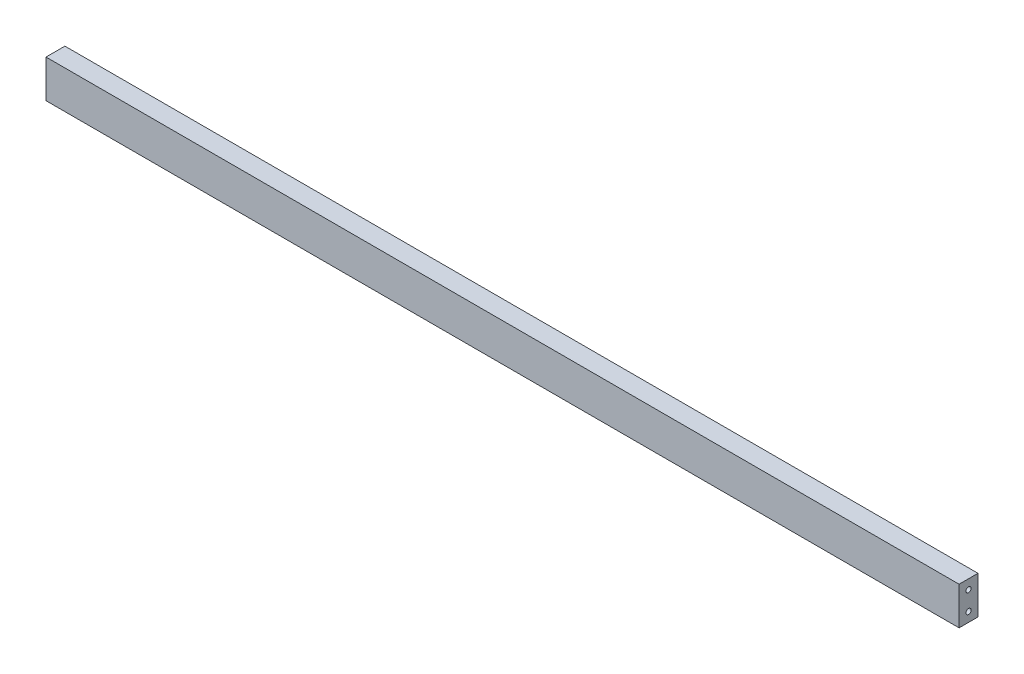
ISO-10303-21;
HEADER;
FILE_DESCRIPTION(('STEP AP214'),'2;1');
FILE_NAME('part.step','',(''),(''),'','','');
FILE_SCHEMA(('AUTOMOTIVE_DESIGN { 1 0 10303 214 1 1 1 1 }'));
ENDSEC;
DATA;
#1=APPLICATION_CONTEXT('core data for automotive mechanical design processes');
#2=APPLICATION_PROTOCOL_DEFINITION('international standard','automotive_design',2000,#1);
#3=PRODUCT_CONTEXT('',#1,'mechanical');
#4=PRODUCT('Part','Part','',(#3));
#5=PRODUCT_RELATED_PRODUCT_CATEGORY('part','',(#4));
#6=PRODUCT_DEFINITION_FORMATION('','',#4);
#7=PRODUCT_DEFINITION_CONTEXT('part definition',#1,'design');
#8=PRODUCT_DEFINITION('design','',#6,#7);
#9=PRODUCT_DEFINITION_SHAPE('','',#8);
#10=(LENGTH_UNIT() NAMED_UNIT(*) SI_UNIT(.MILLI.,.METRE.));
#11=(NAMED_UNIT(*) PLANE_ANGLE_UNIT() SI_UNIT($,.RADIAN.));
#12=(NAMED_UNIT(*) SI_UNIT($,.STERADIAN.) SOLID_ANGLE_UNIT());
#13=UNCERTAINTY_MEASURE_WITH_UNIT(LENGTH_MEASURE(1.E-05),#10,'distance_accuracy_value','');
#14=(GEOMETRIC_REPRESENTATION_CONTEXT(3) GLOBAL_UNCERTAINTY_ASSIGNED_CONTEXT((#13)) GLOBAL_UNIT_ASSIGNED_CONTEXT((#10,
#11,#12)) REPRESENTATION_CONTEXT('',''));
#15=CARTESIAN_POINT('',(0.,0.,0.));
#16=DIRECTION('',(0.,0.,1.));
#17=DIRECTION('',(1.,0.,0.));
#18=AXIS2_PLACEMENT_3D('',#15,#16,#17);
#19=CARTESIAN_POINT('',(521.515,9.99999999999997,0.));
#20=DIRECTION('',(1.,0.,0.));
#21=DIRECTION('',(0.,0.,-1.));
#22=AXIS2_PLACEMENT_3D('',#19,#20,#21);
#23=CYLINDRICAL_SURFACE('',#22,2.75);
#24=CARTESIAN_POINT('',(965.6,9.99999999999994,0.));
#25=DIRECTION('',(-1.,0.,0.));
#26=DIRECTION('',(0.,0.,1.));
#27=AXIS2_PLACEMENT_3D('',#24,#25,#26);
#28=CIRCLE('',#27,2.75);
#29=CARTESIAN_POINT('',(965.6,9.99999999999994,2.75000000000006));
#30=VERTEX_POINT('',#29);
#31=EDGE_CURVE('E109',#30,#30,#28,.F.);
#32=ORIENTED_EDGE('',*,*,#31,.T.);
#33=EDGE_LOOP('',(#32));
#34=FACE_BOUND('',#33,.T.);
#35=CARTESIAN_POINT('',(0.,10.,0.));
#36=DIRECTION('',(1.,0.,0.));
#37=DIRECTION('',(0.,0.,-1.));
#38=AXIS2_PLACEMENT_3D('',#35,#36,#37);
#39=CIRCLE('',#38,2.75);
#40=CARTESIAN_POINT('',(0.,10.,-2.75));
#41=VERTEX_POINT('',#40);
#42=EDGE_CURVE('E38',#41,#41,#39,.F.);
#43=ORIENTED_EDGE('',*,*,#42,.T.);
#44=EDGE_LOOP('',(#43));
#45=FACE_BOUND('',#44,.T.);
#46=ADVANCED_FACE('F35',(#34,#45),#23,.F.);
#47=CARTESIAN_POINT('',(521.515,-10.,0.));
#48=DIRECTION('',(1.,0.,0.));
#49=DIRECTION('',(0.,0.,-1.));
#50=AXIS2_PLACEMENT_3D('',#47,#48,#49);
#51=CYLINDRICAL_SURFACE('',#50,2.75);
#52=CARTESIAN_POINT('',(965.6,-10.0000000000001,0.));
#53=DIRECTION('',(-1.,0.,0.));
#54=DIRECTION('',(0.,0.,1.));
#55=AXIS2_PLACEMENT_3D('',#52,#53,#54);
#56=CIRCLE('',#55,2.75);
#57=CARTESIAN_POINT('',(965.6,-10.0000000000001,2.75000000000006));
#58=VERTEX_POINT('',#57);
#59=EDGE_CURVE('E145',#58,#58,#56,.F.);
#60=ORIENTED_EDGE('',*,*,#59,.T.);
#61=EDGE_LOOP('',(#60));
#62=FACE_BOUND('',#61,.T.);
#63=CARTESIAN_POINT('',(0.,-10.,0.));
#64=DIRECTION('',(1.,0.,0.));
#65=DIRECTION('',(0.,0.,-1.));
#66=AXIS2_PLACEMENT_3D('',#63,#64,#65);
#67=CIRCLE('',#66,2.75);
#68=CARTESIAN_POINT('',(0.,-10.,-2.75));
#69=VERTEX_POINT('',#68);
#70=EDGE_CURVE('E107',#69,#69,#67,.F.);
#71=ORIENTED_EDGE('',*,*,#70,.T.);
#72=EDGE_LOOP('',(#71));
#73=FACE_BOUND('',#72,.T.);
#74=ADVANCED_FACE('F135',(#62,#73),#51,.F.);
#75=CARTESIAN_POINT('',(521.515,0.,10.));
#76=DIRECTION('',(0.,0.,-1.));
#77=DIRECTION('',(-1.,0.,0.));
#78=AXIS2_PLACEMENT_3D('',#75,#76,#77);
#79=PLANE('',#78);
#80=DIRECTION('',(1.,0.,0.));
#81=VECTOR('',#80,1.);
#82=CARTESIAN_POINT('',(521.515,-20.,10.0000000000001));
#83=LINE('',#82,#81);
#84=CARTESIAN_POINT('',(965.6,-19.9999999999999,10.0000000000001));
#85=VERTEX_POINT('',#84);
#86=CARTESIAN_POINT('',(0.,-20.,10.));
#87=VERTEX_POINT('',#86);
#88=EDGE_CURVE('E74',#85,#87,#83,.F.);
#89=ORIENTED_EDGE('',*,*,#88,.F.);
#90=DIRECTION('',(0.,-1.,0.));
#91=VECTOR('',#90,1.);
#92=CARTESIAN_POINT('',(965.6,20.0000000000001,10.0000000000001));
#93=LINE('',#92,#91);
#94=CARTESIAN_POINT('',(965.6,20.0000000000001,10.0000000000001));
#95=VERTEX_POINT('',#94);
#96=EDGE_CURVE('E79',#95,#85,#93,.T.);
#97=ORIENTED_EDGE('',*,*,#96,.F.);
#98=DIRECTION('',(1.,0.,0.));
#99=VECTOR('',#98,1.);
#100=CARTESIAN_POINT('',(521.515,20.,10.0000000000001));
#101=LINE('',#100,#99);
#102=CARTESIAN_POINT('',(0.,20.,10.));
#103=VERTEX_POINT('',#102);
#104=EDGE_CURVE('E91',#95,#103,#101,.F.);
#105=ORIENTED_EDGE('',*,*,#104,.T.);
#106=DIRECTION('',(0.,1.,0.));
#107=VECTOR('',#106,1.);
#108=CARTESIAN_POINT('',(0.,0.,10.));
#109=LINE('',#108,#107);
#110=EDGE_CURVE('E97',#103,#87,#109,.F.);
#111=ORIENTED_EDGE('',*,*,#110,.T.);
#112=EDGE_LOOP('',(#89,#97,#105,#111));
#113=FACE_BOUND('',#112,.T.);
#114=ADVANCED_FACE('F133',(#113),#79,.F.);
#115=CARTESIAN_POINT('',(521.515,-20.,0.));
#116=DIRECTION('',(0.,-1.,0.));
#117=DIRECTION('',(1.,0.,0.));
#118=AXIS2_PLACEMENT_3D('',#115,#116,#117);
#119=PLANE('',#118);
#120=DIRECTION('',(0.,0.,-1.));
#121=VECTOR('',#120,1.);
#122=CARTESIAN_POINT('',(965.6,-19.9999999999999,-9.99999999999996));
#123=LINE('',#122,#121);
#124=CARTESIAN_POINT('',(965.6,-20.,-9.99999999999997));
#125=VERTEX_POINT('',#124);
#126=EDGE_CURVE('E51',#85,#125,#123,.T.);
#127=ORIENTED_EDGE('',*,*,#126,.F.);
#128=ORIENTED_EDGE('',*,*,#88,.T.);
#129=DIRECTION('',(0.,0.,-1.));
#130=VECTOR('',#129,1.);
#131=CARTESIAN_POINT('',(0.,-20.,0.));
#132=LINE('',#131,#130);
#133=CARTESIAN_POINT('',(0.,-20.,-9.99999999999999));
#134=VERTEX_POINT('',#133);
#135=EDGE_CURVE('E105',#87,#134,#132,.T.);
#136=ORIENTED_EDGE('',*,*,#135,.T.);
#137=DIRECTION('',(1.,0.,0.));
#138=VECTOR('',#137,1.);
#139=CARTESIAN_POINT('',(521.515,-20.,-9.99999999999997));
#140=LINE('',#139,#138);
#141=EDGE_CURVE('E95',#134,#125,#140,.T.);
#142=ORIENTED_EDGE('',*,*,#141,.T.);
#143=EDGE_LOOP('',(#127,#128,#136,#142));
#144=FACE_BOUND('',#143,.T.);
#145=ADVANCED_FACE('F126',(#144),#119,.T.);
#146=CARTESIAN_POINT('',(521.515,20.,0.));
#147=DIRECTION('',(0.,-1.,0.));
#148=DIRECTION('',(1.,0.,0.));
#149=AXIS2_PLACEMENT_3D('',#146,#147,#148);
#150=PLANE('',#149);
#151=ORIENTED_EDGE('',*,*,#104,.F.);
#152=DIRECTION('',(0.,0.,1.));
#153=VECTOR('',#152,1.);
#154=CARTESIAN_POINT('',(965.6,20.0000000000001,-9.99999999999996));
#155=LINE('',#154,#153);
#156=CARTESIAN_POINT('',(965.6,20.0000000000001,-9.99999999999996));
#157=VERTEX_POINT('',#156);
#158=EDGE_CURVE('E81',#157,#95,#155,.T.);
#159=ORIENTED_EDGE('',*,*,#158,.F.);
#160=DIRECTION('',(1.,0.,0.));
#161=VECTOR('',#160,1.);
#162=CARTESIAN_POINT('',(521.515,20.0000000000001,-9.99999999999997));
#163=LINE('',#162,#161);
#164=CARTESIAN_POINT('',(0.,20.,-9.99999999999999));
#165=VERTEX_POINT('',#164);
#166=EDGE_CURVE('E43',#157,#165,#163,.F.);
#167=ORIENTED_EDGE('',*,*,#166,.T.);
#168=DIRECTION('',(0.,0.,-1.));
#169=VECTOR('',#168,1.);
#170=CARTESIAN_POINT('',(0.,20.,0.));
#171=LINE('',#170,#169);
#172=EDGE_CURVE('E103',#165,#103,#171,.F.);
#173=ORIENTED_EDGE('',*,*,#172,.T.);
#174=EDGE_LOOP('',(#151,#159,#167,#173));
#175=FACE_BOUND('',#174,.T.);
#176=ADVANCED_FACE('F90',(#175),#150,.F.);
#177=CARTESIAN_POINT('',(0.,0.,0.));
#178=DIRECTION('',(1.,0.,0.));
#179=DIRECTION('',(0.,0.,-1.));
#180=AXIS2_PLACEMENT_3D('',#177,#178,#179);
#181=PLANE('',#180);
#182=ORIENTED_EDGE('',*,*,#172,.F.);
#183=DIRECTION('',(0.,-1.,0.));
#184=VECTOR('',#183,1.);
#185=CARTESIAN_POINT('',(0.,0.,-9.99999999999997));
#186=LINE('',#185,#184);
#187=EDGE_CURVE('E11',#165,#134,#186,.T.);
#188=ORIENTED_EDGE('',*,*,#187,.T.);
#189=ORIENTED_EDGE('',*,*,#135,.F.);
#190=ORIENTED_EDGE('',*,*,#110,.F.);
#191=EDGE_LOOP('',(#182,#188,#189,#190));
#192=FACE_BOUND('',#191,.T.);
#193=ORIENTED_EDGE('',*,*,#70,.F.);
#194=EDGE_LOOP('',(#193));
#195=FACE_BOUND('',#194,.T.);
#196=ORIENTED_EDGE('',*,*,#42,.F.);
#197=EDGE_LOOP('',(#196));
#198=FACE_BOUND('',#197,.T.);
#199=ADVANCED_FACE('F117',(#192,#195,#198),#181,.F.);
#200=CARTESIAN_POINT('',(521.515,0.,-9.99999999999997));
#201=DIRECTION('',(0.,0.,1.));
#202=DIRECTION('',(0.,-1.,0.));
#203=AXIS2_PLACEMENT_3D('',#200,#201,#202);
#204=PLANE('',#203);
#205=ORIENTED_EDGE('',*,*,#166,.F.);
#206=DIRECTION('',(0.,1.,0.));
#207=VECTOR('',#206,1.);
#208=CARTESIAN_POINT('',(965.6,20.0000000000001,-9.99999999999996));
#209=LINE('',#208,#207);
#210=EDGE_CURVE('E83',#125,#157,#209,.T.);
#211=ORIENTED_EDGE('',*,*,#210,.F.);
#212=ORIENTED_EDGE('',*,*,#141,.F.);
#213=ORIENTED_EDGE('',*,*,#187,.F.);
#214=EDGE_LOOP('',(#205,#211,#212,#213));
#215=FACE_BOUND('',#214,.T.);
#216=ADVANCED_FACE('F94',(#215),#204,.F.);
#217=CARTESIAN_POINT('',(965.6,0.,0.));
#218=DIRECTION('',(-1.,0.,0.));
#219=DIRECTION('',(0.,0.,1.));
#220=AXIS2_PLACEMENT_3D('',#217,#218,#219);
#221=PLANE('',#220);
#222=ORIENTED_EDGE('',*,*,#59,.F.);
#223=EDGE_LOOP('',(#222));
#224=FACE_BOUND('',#223,.T.);
#225=ORIENTED_EDGE('',*,*,#210,.T.);
#226=ORIENTED_EDGE('',*,*,#158,.T.);
#227=ORIENTED_EDGE('',*,*,#96,.T.);
#228=ORIENTED_EDGE('',*,*,#126,.T.);
#229=EDGE_LOOP('',(#225,#226,#227,#228));
#230=FACE_BOUND('',#229,.T.);
#231=ORIENTED_EDGE('',*,*,#31,.F.);
#232=EDGE_LOOP('',(#231));
#233=FACE_BOUND('',#232,.T.);
#234=ADVANCED_FACE('F84',(#224,#230,#233),#221,.F.);
#235=CLOSED_SHELL('',(#46,#74,#114,#145,#176,#199,#216,#234));
#236=MANIFOLD_SOLID_BREP('B2',#235);
#237=ADVANCED_BREP_SHAPE_REPRESENTATION('',(#18,#236),#14);
#238=SHAPE_DEFINITION_REPRESENTATION(#9,#237);
ENDSEC;
END-ISO-10303-21;
